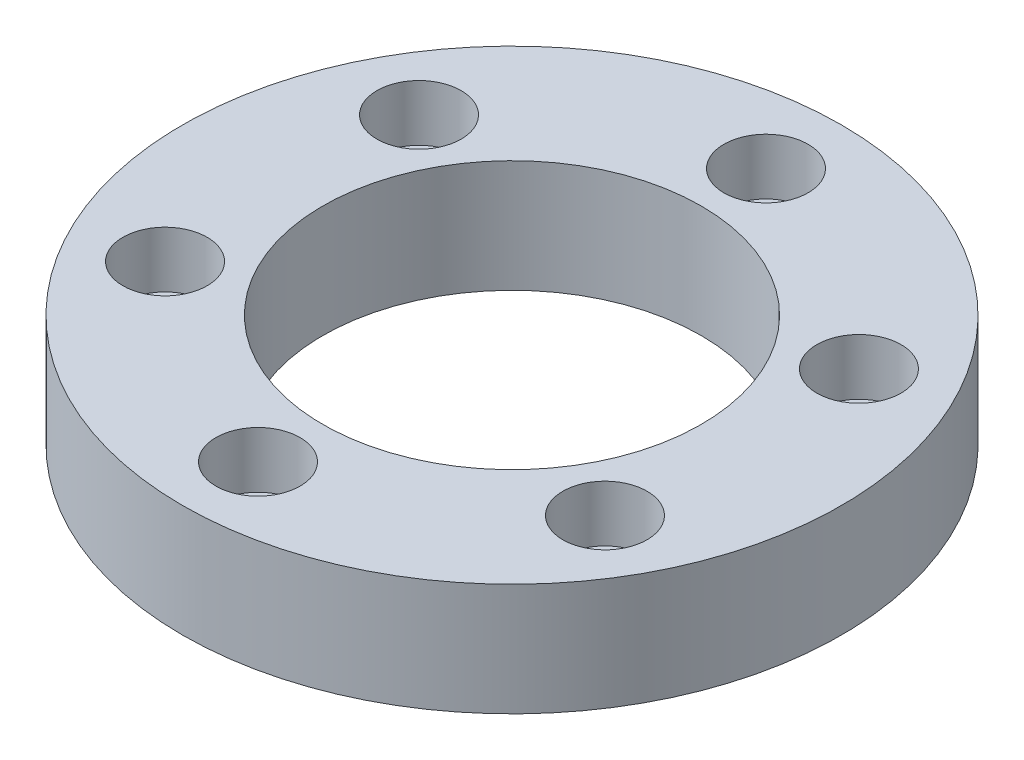
ISO-10303-21;
HEADER;
FILE_DESCRIPTION(('STEP AP214'),'2;1');
FILE_NAME('part.step','',(''),(''),'','','');
FILE_SCHEMA(('AUTOMOTIVE_DESIGN { 1 0 10303 214 1 1 1 1 }'));
ENDSEC;
DATA;
#1=APPLICATION_CONTEXT('core data for automotive mechanical design processes');
#2=APPLICATION_PROTOCOL_DEFINITION('international standard','automotive_design',2000,#1);
#3=PRODUCT_CONTEXT('',#1,'mechanical');
#4=PRODUCT('Part','Part','',(#3));
#5=PRODUCT_RELATED_PRODUCT_CATEGORY('part','',(#4));
#6=PRODUCT_DEFINITION_FORMATION('','',#4);
#7=PRODUCT_DEFINITION_CONTEXT('part definition',#1,'design');
#8=PRODUCT_DEFINITION('design','',#6,#7);
#9=PRODUCT_DEFINITION_SHAPE('','',#8);
#10=(LENGTH_UNIT() NAMED_UNIT(*) SI_UNIT(.MILLI.,.METRE.));
#11=(NAMED_UNIT(*) PLANE_ANGLE_UNIT() SI_UNIT($,.RADIAN.));
#12=(NAMED_UNIT(*) SI_UNIT($,.STERADIAN.) SOLID_ANGLE_UNIT());
#13=UNCERTAINTY_MEASURE_WITH_UNIT(LENGTH_MEASURE(1.E-05),#10,'distance_accuracy_value','');
#14=(GEOMETRIC_REPRESENTATION_CONTEXT(3) GLOBAL_UNCERTAINTY_ASSIGNED_CONTEXT((#13)) GLOBAL_UNIT_ASSIGNED_CONTEXT((#10,
#11,#12)) REPRESENTATION_CONTEXT('',''));
#15=CARTESIAN_POINT('',(0.,0.,0.));
#16=DIRECTION('',(0.,0.,1.));
#17=DIRECTION('',(1.,0.,0.));
#18=AXIS2_PLACEMENT_3D('',#15,#16,#17);
#19=CARTESIAN_POINT('',(-15.6750598084982,-2.,-9.05000000000018));
#20=DIRECTION('',(0.,1.,0.));
#21=DIRECTION('',(0.,0.,1.));
#22=AXIS2_PLACEMENT_3D('',#19,#20,#21);
#23=CYLINDRICAL_SURFACE('',#22,1.75);
#24=CARTESIAN_POINT('',(-15.6750598084982,0.,-9.05000000000018));
#25=DIRECTION('',(0.,-1.,0.));
#26=DIRECTION('',(0.,0.,-1.));
#27=AXIS2_PLACEMENT_3D('',#24,#25,#26);
#28=CIRCLE('',#27,1.75);
#29=CARTESIAN_POINT('',(-15.6750598084982,0.,-10.8000000000002));
#30=VERTEX_POINT('',#29);
#31=EDGE_CURVE('E74',#30,#30,#28,.T.);
#32=ORIENTED_EDGE('',*,*,#31,.T.);
#33=EDGE_LOOP('',(#32));
#34=FACE_BOUND('',#33,.T.);
#35=CARTESIAN_POINT('',(-15.6750598084982,4.,-9.05000000000018));
#36=DIRECTION('',(0.,1.,0.));
#37=DIRECTION('',(0.,0.,1.));
#38=AXIS2_PLACEMENT_3D('',#35,#36,#37);
#39=CIRCLE('',#38,1.75);
#40=CARTESIAN_POINT('',(-15.6750598084982,4.,-7.30000000000018));
#41=VERTEX_POINT('',#40);
#42=EDGE_CURVE('E81',#41,#41,#39,.T.);
#43=ORIENTED_EDGE('',*,*,#42,.T.);
#44=EDGE_LOOP('',(#43));
#45=FACE_BOUND('',#44,.T.);
#46=ADVANCED_FACE('F39',(#34,#45),#23,.F.);
#47=CARTESIAN_POINT('',(-15.6750598084984,-2.,9.04999999999986));
#48=DIRECTION('',(0.,1.,0.));
#49=DIRECTION('',(0.,0.,1.));
#50=AXIS2_PLACEMENT_3D('',#47,#48,#49);
#51=CYLINDRICAL_SURFACE('',#50,1.75);
#52=CARTESIAN_POINT('',(-15.6750598084984,0.,9.04999999999986));
#53=DIRECTION('',(0.,-1.,0.));
#54=DIRECTION('',(0.,0.,-1.));
#55=AXIS2_PLACEMENT_3D('',#52,#53,#54);
#56=CIRCLE('',#55,1.75);
#57=CARTESIAN_POINT('',(-15.6750598084984,0.,7.29999999999985));
#58=VERTEX_POINT('',#57);
#59=EDGE_CURVE('E71',#58,#58,#56,.T.);
#60=ORIENTED_EDGE('',*,*,#59,.T.);
#61=EDGE_LOOP('',(#60));
#62=FACE_BOUND('',#61,.T.);
#63=CARTESIAN_POINT('',(-15.6750598084984,4.,9.04999999999986));
#64=DIRECTION('',(0.,1.,0.));
#65=DIRECTION('',(0.,0.,1.));
#66=AXIS2_PLACEMENT_3D('',#63,#64,#65);
#67=CIRCLE('',#66,1.75);
#68=CARTESIAN_POINT('',(-15.6750598084984,4.,10.7999999999999));
#69=VERTEX_POINT('',#68);
#70=EDGE_CURVE('E100',#69,#69,#67,.T.);
#71=ORIENTED_EDGE('',*,*,#70,.T.);
#72=EDGE_LOOP('',(#71));
#73=FACE_BOUND('',#72,.T.);
#74=ADVANCED_FACE('F172',(#62,#73),#51,.F.);
#75=CARTESIAN_POINT('',(-1.26391624466121E-13,-2.,18.1));
#76=DIRECTION('',(0.,1.,0.));
#77=DIRECTION('',(0.,0.,1.));
#78=AXIS2_PLACEMENT_3D('',#75,#76,#77);
#79=CYLINDRICAL_SURFACE('',#78,1.75);
#80=CARTESIAN_POINT('',(-1.26391624466121E-13,0.,18.1));
#81=DIRECTION('',(0.,-1.,0.));
#82=DIRECTION('',(0.,0.,-1.));
#83=AXIS2_PLACEMENT_3D('',#80,#81,#82);
#84=CIRCLE('',#83,1.75);
#85=CARTESIAN_POINT('',(-1.26391624466121E-13,0.,16.35));
#86=VERTEX_POINT('',#85);
#87=EDGE_CURVE('E68',#86,#86,#84,.T.);
#88=ORIENTED_EDGE('',*,*,#87,.T.);
#89=EDGE_LOOP('',(#88));
#90=FACE_BOUND('',#89,.T.);
#91=CARTESIAN_POINT('',(-1.26391624466121E-13,4.,18.1));
#92=DIRECTION('',(0.,1.,0.));
#93=DIRECTION('',(0.,0.,1.));
#94=AXIS2_PLACEMENT_3D('',#91,#92,#93);
#95=CIRCLE('',#94,1.75);
#96=CARTESIAN_POINT('',(-1.26391624466121E-13,4.,19.85));
#97=VERTEX_POINT('',#96);
#98=EDGE_CURVE('E90',#97,#97,#95,.T.);
#99=ORIENTED_EDGE('',*,*,#98,.T.);
#100=EDGE_LOOP('',(#99));
#101=FACE_BOUND('',#100,.T.);
#102=ADVANCED_FACE('F178',(#90,#101),#79,.F.);
#103=CARTESIAN_POINT('',(15.6750598084983,-2.,9.05000000000008));
#104=DIRECTION('',(0.,1.,0.));
#105=DIRECTION('',(0.,0.,1.));
#106=AXIS2_PLACEMENT_3D('',#103,#104,#105);
#107=CYLINDRICAL_SURFACE('',#106,1.75);
#108=CARTESIAN_POINT('',(15.6750598084983,0.,9.05000000000008));
#109=DIRECTION('',(0.,-1.,0.));
#110=DIRECTION('',(0.,0.,-1.));
#111=AXIS2_PLACEMENT_3D('',#108,#109,#110);
#112=CIRCLE('',#111,1.75);
#113=CARTESIAN_POINT('',(15.6750598084983,0.,7.30000000000008));
#114=VERTEX_POINT('',#113);
#115=EDGE_CURVE('E65',#114,#114,#112,.T.);
#116=ORIENTED_EDGE('',*,*,#115,.T.);
#117=EDGE_LOOP('',(#116));
#118=FACE_BOUND('',#117,.T.);
#119=CARTESIAN_POINT('',(15.6750598084983,4.,9.05000000000008));
#120=DIRECTION('',(0.,1.,0.));
#121=DIRECTION('',(0.,0.,1.));
#122=AXIS2_PLACEMENT_3D('',#119,#120,#121);
#123=CIRCLE('',#122,1.75);
#124=CARTESIAN_POINT('',(15.6750598084983,4.,10.8000000000001));
#125=VERTEX_POINT('',#124);
#126=EDGE_CURVE('E126',#125,#125,#123,.T.);
#127=ORIENTED_EDGE('',*,*,#126,.T.);
#128=EDGE_LOOP('',(#127));
#129=FACE_BOUND('',#128,.T.);
#130=ADVANCED_FACE('F132',(#118,#129),#107,.F.);
#131=CARTESIAN_POINT('',(15.6750598084984,-2.,-9.04999999999997));
#132=DIRECTION('',(0.,1.,0.));
#133=DIRECTION('',(0.,0.,1.));
#134=AXIS2_PLACEMENT_3D('',#131,#132,#133);
#135=CYLINDRICAL_SURFACE('',#134,1.75);
#136=CARTESIAN_POINT('',(15.6750598084984,0.,-9.04999999999997));
#137=DIRECTION('',(0.,-1.,0.));
#138=DIRECTION('',(0.,0.,-1.));
#139=AXIS2_PLACEMENT_3D('',#136,#137,#138);
#140=CIRCLE('',#139,1.75);
#141=CARTESIAN_POINT('',(15.6750598084984,0.,-10.8));
#142=VERTEX_POINT('',#141);
#143=EDGE_CURVE('E62',#142,#142,#140,.T.);
#144=ORIENTED_EDGE('',*,*,#143,.T.);
#145=EDGE_LOOP('',(#144));
#146=FACE_BOUND('',#145,.T.);
#147=CARTESIAN_POINT('',(15.6750598084984,4.,-9.04999999999997));
#148=DIRECTION('',(0.,1.,0.));
#149=DIRECTION('',(0.,0.,1.));
#150=AXIS2_PLACEMENT_3D('',#147,#148,#149);
#151=CIRCLE('',#150,1.75);
#152=CARTESIAN_POINT('',(15.6750598084984,4.,-7.29999999999997));
#153=VERTEX_POINT('',#152);
#154=EDGE_CURVE('E109',#153,#153,#151,.T.);
#155=ORIENTED_EDGE('',*,*,#154,.T.);
#156=EDGE_LOOP('',(#155));
#157=FACE_BOUND('',#156,.T.);
#158=ADVANCED_FACE('F183',(#146,#157),#135,.F.);
#159=CARTESIAN_POINT('',(0.,-2.,-18.1));
#160=DIRECTION('',(0.,1.,0.));
#161=DIRECTION('',(0.,0.,1.));
#162=AXIS2_PLACEMENT_3D('',#159,#160,#161);
#163=CYLINDRICAL_SURFACE('',#162,1.75);
#164=CARTESIAN_POINT('',(0.,0.,-18.1));
#165=DIRECTION('',(0.,-1.,0.));
#166=DIRECTION('',(0.,0.,-1.));
#167=AXIS2_PLACEMENT_3D('',#164,#165,#166);
#168=CIRCLE('',#167,1.75);
#169=CARTESIAN_POINT('',(0.,0.,-19.85));
#170=VERTEX_POINT('',#169);
#171=EDGE_CURVE('E59',#170,#170,#168,.T.);
#172=ORIENTED_EDGE('',*,*,#171,.T.);
#173=EDGE_LOOP('',(#172));
#174=FACE_BOUND('',#173,.T.);
#175=CARTESIAN_POINT('',(0.,4.,-18.1));
#176=DIRECTION('',(0.,1.,0.));
#177=DIRECTION('',(0.,0.,1.));
#178=AXIS2_PLACEMENT_3D('',#175,#176,#177);
#179=CIRCLE('',#178,1.75);
#180=CARTESIAN_POINT('',(0.,4.,-16.35));
#181=VERTEX_POINT('',#180);
#182=EDGE_CURVE('E118',#181,#181,#179,.T.);
#183=ORIENTED_EDGE('',*,*,#182,.T.);
#184=EDGE_LOOP('',(#183));
#185=FACE_BOUND('',#184,.T.);
#186=ADVANCED_FACE('F193',(#174,#185),#163,.F.);
#187=CARTESIAN_POINT('',(0.,0.,-13.485));
#188=DIRECTION('',(0.,-1.,0.));
#189=DIRECTION('',(0.,0.,-1.));
#190=AXIS2_PLACEMENT_3D('',#187,#188,#189);
#191=PLANE('',#190);
#192=ORIENTED_EDGE('',*,*,#171,.F.);
#193=EDGE_LOOP('',(#192));
#194=FACE_BOUND('',#193,.T.);
#195=ORIENTED_EDGE('',*,*,#143,.F.);
#196=EDGE_LOOP('',(#195));
#197=FACE_BOUND('',#196,.T.);
#198=ORIENTED_EDGE('',*,*,#115,.F.);
#199=EDGE_LOOP('',(#198));
#200=FACE_BOUND('',#199,.T.);
#201=ORIENTED_EDGE('',*,*,#87,.F.);
#202=EDGE_LOOP('',(#201));
#203=FACE_BOUND('',#202,.T.);
#204=ORIENTED_EDGE('',*,*,#59,.F.);
#205=EDGE_LOOP('',(#204));
#206=FACE_BOUND('',#205,.T.);
#207=ORIENTED_EDGE('',*,*,#31,.F.);
#208=EDGE_LOOP('',(#207));
#209=FACE_BOUND('',#208,.T.);
#210=CARTESIAN_POINT('',(0.,0.,0.));
#211=DIRECTION('',(0.,-1.,0.));
#212=DIRECTION('',(0.,0.,-1.));
#213=AXIS2_PLACEMENT_3D('',#210,#211,#212);
#214=CIRCLE('',#213,23.485);
#215=CARTESIAN_POINT('',(0.,0.,-23.485));
#216=VERTEX_POINT('',#215);
#217=EDGE_CURVE('E10',#216,#216,#214,.T.);
#218=ORIENTED_EDGE('',*,*,#217,.T.);
#219=EDGE_LOOP('',(#218));
#220=FACE_BOUND('',#219,.T.);
#221=CARTESIAN_POINT('',(0.,0.,0.));
#222=DIRECTION('',(0.,-1.,0.));
#223=DIRECTION('',(0.,0.,-1.));
#224=AXIS2_PLACEMENT_3D('',#221,#222,#223);
#225=CIRCLE('',#224,13.485);
#226=CARTESIAN_POINT('',(0.,0.,-13.485));
#227=VERTEX_POINT('',#226);
#228=EDGE_CURVE('E54',#227,#227,#225,.T.);
#229=ORIENTED_EDGE('',*,*,#228,.F.);
#230=EDGE_LOOP('',(#229));
#231=FACE_BOUND('',#230,.T.);
#232=ADVANCED_FACE('F41',(#194,#197,#200,#203,#206,#209,#220,#231),#191,.T.);
#233=CARTESIAN_POINT('',(0.,0.,0.));
#234=DIRECTION('',(0.,-1.,0.));
#235=DIRECTION('',(0.,0.,-1.));
#236=AXIS2_PLACEMENT_3D('',#233,#234,#235);
#237=CYLINDRICAL_SURFACE('',#236,23.485);
#238=CARTESIAN_POINT('',(0.,8.,0.));
#239=DIRECTION('',(0.,-1.,0.));
#240=DIRECTION('',(0.,0.,-1.));
#241=AXIS2_PLACEMENT_3D('',#238,#239,#240);
#242=CIRCLE('',#241,23.485);
#243=CARTESIAN_POINT('',(0.,8.,-23.485));
#244=VERTEX_POINT('',#243);
#245=EDGE_CURVE('E46',#244,#244,#242,.T.);
#246=ORIENTED_EDGE('',*,*,#245,.T.);
#247=EDGE_LOOP('',(#246));
#248=FACE_BOUND('',#247,.T.);
#249=ORIENTED_EDGE('',*,*,#217,.F.);
#250=EDGE_LOOP('',(#249));
#251=FACE_BOUND('',#250,.T.);
#252=ADVANCED_FACE('F152',(#248,#251),#237,.T.);
#253=CARTESIAN_POINT('',(0.,8.,-23.485));
#254=DIRECTION('',(0.,1.,0.));
#255=DIRECTION('',(0.,0.,1.));
#256=AXIS2_PLACEMENT_3D('',#253,#254,#255);
#257=PLANE('',#256);
#258=CARTESIAN_POINT('',(0.,8.,-18.1));
#259=DIRECTION('',(0.,1.,0.));
#260=DIRECTION('',(0.,0.,1.));
#261=AXIS2_PLACEMENT_3D('',#258,#259,#260);
#262=CIRCLE('',#261,3.);
#263=CARTESIAN_POINT('',(0.,8.,-15.1));
#264=VERTEX_POINT('',#263);
#265=EDGE_CURVE('E113',#264,#264,#262,.T.);
#266=ORIENTED_EDGE('',*,*,#265,.F.);
#267=EDGE_LOOP('',(#266));
#268=FACE_BOUND('',#267,.T.);
#269=CARTESIAN_POINT('',(15.6750598084984,8.,-9.04999999999997));
#270=DIRECTION('',(0.,1.,0.));
#271=DIRECTION('',(0.,0.,1.));
#272=AXIS2_PLACEMENT_3D('',#269,#270,#271);
#273=CIRCLE('',#272,3.);
#274=CARTESIAN_POINT('',(15.6750598084984,8.,-6.04999999999997));
#275=VERTEX_POINT('',#274);
#276=EDGE_CURVE('E104',#275,#275,#273,.T.);
#277=ORIENTED_EDGE('',*,*,#276,.F.);
#278=EDGE_LOOP('',(#277));
#279=FACE_BOUND('',#278,.T.);
#280=CARTESIAN_POINT('',(-15.6750598084984,8.,9.04999999999986));
#281=DIRECTION('',(0.,1.,0.));
#282=DIRECTION('',(0.,0.,1.));
#283=AXIS2_PLACEMENT_3D('',#280,#281,#282);
#284=CIRCLE('',#283,3.);
#285=CARTESIAN_POINT('',(-15.6750598084984,8.,12.0499999999999));
#286=VERTEX_POINT('',#285);
#287=EDGE_CURVE('E95',#286,#286,#284,.T.);
#288=ORIENTED_EDGE('',*,*,#287,.F.);
#289=EDGE_LOOP('',(#288));
#290=FACE_BOUND('',#289,.T.);
#291=CARTESIAN_POINT('',(-1.26391624466121E-13,8.,18.1));
#292=DIRECTION('',(0.,1.,0.));
#293=DIRECTION('',(0.,0.,1.));
#294=AXIS2_PLACEMENT_3D('',#291,#292,#293);
#295=CIRCLE('',#294,3.);
#296=CARTESIAN_POINT('',(-1.26391624466121E-13,8.,21.1));
#297=VERTEX_POINT('',#296);
#298=EDGE_CURVE('E87',#297,#297,#295,.T.);
#299=ORIENTED_EDGE('',*,*,#298,.F.);
#300=EDGE_LOOP('',(#299));
#301=FACE_BOUND('',#300,.T.);
#302=CARTESIAN_POINT('',(15.6750598084983,8.,9.05000000000008));
#303=DIRECTION('',(0.,1.,0.));
#304=DIRECTION('',(0.,0.,1.));
#305=AXIS2_PLACEMENT_3D('',#302,#303,#304);
#306=CIRCLE('',#305,3.);
#307=CARTESIAN_POINT('',(15.6750598084983,8.,12.0500000000001));
#308=VERTEX_POINT('',#307);
#309=EDGE_CURVE('E123',#308,#308,#306,.T.);
#310=ORIENTED_EDGE('',*,*,#309,.F.);
#311=EDGE_LOOP('',(#310));
#312=FACE_BOUND('',#311,.T.);
#313=CARTESIAN_POINT('',(-15.6750598084982,8.,-9.05000000000018));
#314=DIRECTION('',(0.,1.,0.));
#315=DIRECTION('',(0.,0.,1.));
#316=AXIS2_PLACEMENT_3D('',#313,#314,#315);
#317=CIRCLE('',#316,3.);
#318=CARTESIAN_POINT('',(-15.6750598084982,8.,-6.05000000000018));
#319=VERTEX_POINT('',#318);
#320=EDGE_CURVE('E78',#319,#319,#317,.T.);
#321=ORIENTED_EDGE('',*,*,#320,.F.);
#322=EDGE_LOOP('',(#321));
#323=FACE_BOUND('',#322,.T.);
#324=CARTESIAN_POINT('',(0.,8.,0.));
#325=DIRECTION('',(0.,-1.,0.));
#326=DIRECTION('',(0.,0.,-1.));
#327=AXIS2_PLACEMENT_3D('',#324,#325,#326);
#328=CIRCLE('',#327,13.485);
#329=CARTESIAN_POINT('',(0.,8.,-13.485));
#330=VERTEX_POINT('',#329);
#331=EDGE_CURVE('E50',#330,#330,#328,.T.);
#332=ORIENTED_EDGE('',*,*,#331,.T.);
#333=EDGE_LOOP('',(#332));
#334=FACE_BOUND('',#333,.T.);
#335=ORIENTED_EDGE('',*,*,#245,.F.);
#336=EDGE_LOOP('',(#335));
#337=FACE_BOUND('',#336,.T.);
#338=ADVANCED_FACE('F148',(#268,#279,#290,#301,#312,#323,#334,#337),#257,.T.);
#339=CARTESIAN_POINT('',(0.,0.,0.));
#340=DIRECTION('',(0.,-1.,0.));
#341=DIRECTION('',(0.,0.,-1.));
#342=AXIS2_PLACEMENT_3D('',#339,#340,#341);
#343=CYLINDRICAL_SURFACE('',#342,13.485);
#344=ORIENTED_EDGE('',*,*,#228,.T.);
#345=EDGE_LOOP('',(#344));
#346=FACE_BOUND('',#345,.T.);
#347=ORIENTED_EDGE('',*,*,#331,.F.);
#348=EDGE_LOOP('',(#347));
#349=FACE_BOUND('',#348,.T.);
#350=ADVANCED_FACE('F151',(#346,#349),#343,.F.);
#351=CARTESIAN_POINT('',(0.,4.,-18.1));
#352=DIRECTION('',(0.,1.,0.));
#353=DIRECTION('',(0.,0.,1.));
#354=AXIS2_PLACEMENT_3D('',#351,#352,#353);
#355=CYLINDRICAL_SURFACE('',#354,3.);
#356=CARTESIAN_POINT('',(0.,4.,-18.1));
#357=DIRECTION('',(0.,1.,0.));
#358=DIRECTION('',(0.,0.,1.));
#359=AXIS2_PLACEMENT_3D('',#356,#357,#358);
#360=CIRCLE('',#359,3.);
#361=CARTESIAN_POINT('',(0.,4.,-15.1));
#362=VERTEX_POINT('',#361);
#363=EDGE_CURVE('E82',#362,#362,#360,.T.);
#364=ORIENTED_EDGE('',*,*,#363,.F.);
#365=EDGE_LOOP('',(#364));
#366=FACE_BOUND('',#365,.T.);
#367=ORIENTED_EDGE('',*,*,#265,.T.);
#368=EDGE_LOOP('',(#367));
#369=FACE_BOUND('',#368,.T.);
#370=ADVANCED_FACE('F161',(#366,#369),#355,.F.);
#371=CARTESIAN_POINT('',(0.,4.,0.));
#372=DIRECTION('',(0.,1.,0.));
#373=DIRECTION('',(0.,0.,1.));
#374=AXIS2_PLACEMENT_3D('',#371,#372,#373);
#375=PLANE('',#374);
#376=ORIENTED_EDGE('',*,*,#182,.F.);
#377=EDGE_LOOP('',(#376));
#378=FACE_BOUND('',#377,.T.);
#379=ORIENTED_EDGE('',*,*,#363,.T.);
#380=EDGE_LOOP('',(#379));
#381=FACE_BOUND('',#380,.T.);
#382=ADVANCED_FACE('F167',(#378,#381),#375,.T.);
#383=CARTESIAN_POINT('',(15.6750598084984,4.,-9.04999999999997));
#384=DIRECTION('',(0.,1.,0.));
#385=DIRECTION('',(0.,0.,1.));
#386=AXIS2_PLACEMENT_3D('',#383,#384,#385);
#387=CYLINDRICAL_SURFACE('',#386,3.);
#388=CARTESIAN_POINT('',(15.6750598084984,4.,-9.04999999999997));
#389=DIRECTION('',(0.,1.,0.));
#390=DIRECTION('',(0.,0.,1.));
#391=AXIS2_PLACEMENT_3D('',#388,#389,#390);
#392=CIRCLE('',#391,3.);
#393=CARTESIAN_POINT('',(15.6750598084984,4.,-6.04999999999997));
#394=VERTEX_POINT('',#393);
#395=EDGE_CURVE('E110',#394,#394,#392,.T.);
#396=ORIENTED_EDGE('',*,*,#395,.F.);
#397=EDGE_LOOP('',(#396));
#398=FACE_BOUND('',#397,.T.);
#399=ORIENTED_EDGE('',*,*,#276,.T.);
#400=EDGE_LOOP('',(#399));
#401=FACE_BOUND('',#400,.T.);
#402=ADVANCED_FACE('F253',(#398,#401),#387,.F.);
#403=CARTESIAN_POINT('',(0.,4.,0.));
#404=DIRECTION('',(0.,1.,0.));
#405=DIRECTION('',(0.,0.,1.));
#406=AXIS2_PLACEMENT_3D('',#403,#404,#405);
#407=PLANE('',#406);
#408=ORIENTED_EDGE('',*,*,#154,.F.);
#409=EDGE_LOOP('',(#408));
#410=FACE_BOUND('',#409,.T.);
#411=ORIENTED_EDGE('',*,*,#395,.T.);
#412=EDGE_LOOP('',(#411));
#413=FACE_BOUND('',#412,.T.);
#414=ADVANCED_FACE('F144',(#410,#413),#407,.T.);
#415=CARTESIAN_POINT('',(15.6750598084983,4.,9.05000000000008));
#416=DIRECTION('',(0.,1.,0.));
#417=DIRECTION('',(0.,0.,1.));
#418=AXIS2_PLACEMENT_3D('',#415,#416,#417);
#419=CYLINDRICAL_SURFACE('',#418,3.);
#420=CARTESIAN_POINT('',(15.6750598084983,4.,9.05000000000008));
#421=DIRECTION('',(0.,1.,0.));
#422=DIRECTION('',(0.,0.,1.));
#423=AXIS2_PLACEMENT_3D('',#420,#421,#422);
#424=CIRCLE('',#423,3.);
#425=CARTESIAN_POINT('',(15.6750598084983,4.,12.0500000000001));
#426=VERTEX_POINT('',#425);
#427=EDGE_CURVE('E91',#426,#426,#424,.T.);
#428=ORIENTED_EDGE('',*,*,#427,.F.);
#429=EDGE_LOOP('',(#428));
#430=FACE_BOUND('',#429,.T.);
#431=ORIENTED_EDGE('',*,*,#309,.T.);
#432=EDGE_LOOP('',(#431));
#433=FACE_BOUND('',#432,.T.);
#434=ADVANCED_FACE('F138',(#430,#433),#419,.F.);
#435=CARTESIAN_POINT('',(0.,4.,0.));
#436=DIRECTION('',(0.,1.,0.));
#437=DIRECTION('',(0.,0.,1.));
#438=AXIS2_PLACEMENT_3D('',#435,#436,#437);
#439=PLANE('',#438);
#440=ORIENTED_EDGE('',*,*,#126,.F.);
#441=EDGE_LOOP('',(#440));
#442=FACE_BOUND('',#441,.T.);
#443=ORIENTED_EDGE('',*,*,#427,.T.);
#444=EDGE_LOOP('',(#443));
#445=FACE_BOUND('',#444,.T.);
#446=ADVANCED_FACE('F134',(#442,#445),#439,.T.);
#447=CARTESIAN_POINT('',(-1.26391624466121E-13,4.,18.1));
#448=DIRECTION('',(0.,1.,0.));
#449=DIRECTION('',(0.,0.,1.));
#450=AXIS2_PLACEMENT_3D('',#447,#448,#449);
#451=CYLINDRICAL_SURFACE('',#450,3.);
#452=CARTESIAN_POINT('',(-1.26391624466121E-13,4.,18.1));
#453=DIRECTION('',(0.,1.,0.));
#454=DIRECTION('',(0.,0.,1.));
#455=AXIS2_PLACEMENT_3D('',#452,#453,#454);
#456=CIRCLE('',#455,3.);
#457=CARTESIAN_POINT('',(-1.26391624466121E-13,4.,21.1));
#458=VERTEX_POINT('',#457);
#459=EDGE_CURVE('E92',#458,#458,#456,.T.);
#460=ORIENTED_EDGE('',*,*,#459,.F.);
#461=EDGE_LOOP('',(#460));
#462=FACE_BOUND('',#461,.T.);
#463=ORIENTED_EDGE('',*,*,#298,.T.);
#464=EDGE_LOOP('',(#463));
#465=FACE_BOUND('',#464,.T.);
#466=ADVANCED_FACE('F137',(#462,#465),#451,.F.);
#467=CARTESIAN_POINT('',(0.,4.,0.));
#468=DIRECTION('',(0.,1.,0.));
#469=DIRECTION('',(0.,0.,1.));
#470=AXIS2_PLACEMENT_3D('',#467,#468,#469);
#471=PLANE('',#470);
#472=ORIENTED_EDGE('',*,*,#98,.F.);
#473=EDGE_LOOP('',(#472));
#474=FACE_BOUND('',#473,.T.);
#475=ORIENTED_EDGE('',*,*,#459,.T.);
#476=EDGE_LOOP('',(#475));
#477=FACE_BOUND('',#476,.T.);
#478=ADVANCED_FACE('F220',(#474,#477),#471,.T.);
#479=CARTESIAN_POINT('',(-15.6750598084984,4.,9.04999999999986));
#480=DIRECTION('',(0.,1.,0.));
#481=DIRECTION('',(0.,0.,1.));
#482=AXIS2_PLACEMENT_3D('',#479,#480,#481);
#483=CYLINDRICAL_SURFACE('',#482,3.);
#484=CARTESIAN_POINT('',(-15.6750598084984,4.,9.04999999999986));
#485=DIRECTION('',(0.,1.,0.));
#486=DIRECTION('',(0.,0.,1.));
#487=AXIS2_PLACEMENT_3D('',#484,#485,#486);
#488=CIRCLE('',#487,3.);
#489=CARTESIAN_POINT('',(-15.6750598084984,4.,12.0499999999999));
#490=VERTEX_POINT('',#489);
#491=EDGE_CURVE('E101',#490,#490,#488,.T.);
#492=ORIENTED_EDGE('',*,*,#491,.F.);
#493=EDGE_LOOP('',(#492));
#494=FACE_BOUND('',#493,.T.);
#495=ORIENTED_EDGE('',*,*,#287,.T.);
#496=EDGE_LOOP('',(#495));
#497=FACE_BOUND('',#496,.T.);
#498=ADVANCED_FACE('F214',(#494,#497),#483,.F.);
#499=CARTESIAN_POINT('',(0.,4.,0.));
#500=DIRECTION('',(0.,1.,0.));
#501=DIRECTION('',(0.,0.,1.));
#502=AXIS2_PLACEMENT_3D('',#499,#500,#501);
#503=PLANE('',#502);
#504=ORIENTED_EDGE('',*,*,#70,.F.);
#505=EDGE_LOOP('',(#504));
#506=FACE_BOUND('',#505,.T.);
#507=ORIENTED_EDGE('',*,*,#491,.T.);
#508=EDGE_LOOP('',(#507));
#509=FACE_BOUND('',#508,.T.);
#510=ADVANCED_FACE('F210',(#506,#509),#503,.T.);
#511=CARTESIAN_POINT('',(-15.6750598084982,4.,-9.05000000000018));
#512=DIRECTION('',(0.,1.,0.));
#513=DIRECTION('',(0.,0.,1.));
#514=AXIS2_PLACEMENT_3D('',#511,#512,#513);
#515=CYLINDRICAL_SURFACE('',#514,3.);
#516=CARTESIAN_POINT('',(-15.6750598084982,4.,-9.05000000000018));
#517=DIRECTION('',(0.,1.,0.));
#518=DIRECTION('',(0.,0.,1.));
#519=AXIS2_PLACEMENT_3D('',#516,#517,#518);
#520=CIRCLE('',#519,3.);
#521=CARTESIAN_POINT('',(-15.6750598084982,4.,-6.05000000000018));
#522=VERTEX_POINT('',#521);
#523=EDGE_CURVE('E77',#522,#522,#520,.T.);
#524=ORIENTED_EDGE('',*,*,#523,.F.);
#525=EDGE_LOOP('',(#524));
#526=FACE_BOUND('',#525,.T.);
#527=ORIENTED_EDGE('',*,*,#320,.T.);
#528=EDGE_LOOP('',(#527));
#529=FACE_BOUND('',#528,.T.);
#530=ADVANCED_FACE('F213',(#526,#529),#515,.F.);
#531=CARTESIAN_POINT('',(0.,4.,0.));
#532=DIRECTION('',(0.,1.,0.));
#533=DIRECTION('',(0.,0.,1.));
#534=AXIS2_PLACEMENT_3D('',#531,#532,#533);
#535=PLANE('',#534);
#536=ORIENTED_EDGE('',*,*,#42,.F.);
#537=EDGE_LOOP('',(#536));
#538=FACE_BOUND('',#537,.T.);
#539=ORIENTED_EDGE('',*,*,#523,.T.);
#540=EDGE_LOOP('',(#539));
#541=FACE_BOUND('',#540,.T.);
#542=ADVANCED_FACE('F237',(#538,#541),#535,.T.);
#543=CLOSED_SHELL('',(#46,#74,#102,#130,#158,#186,#232,#252,#338,#350,#370,#382,#402,#414,#434,
#446,#466,#478,#498,#510,#530,#542));
#544=MANIFOLD_SOLID_BREP('B2',#543);
#545=ADVANCED_BREP_SHAPE_REPRESENTATION('',(#18,#544),#14);
#546=SHAPE_DEFINITION_REPRESENTATION(#9,#545);
ENDSEC;
END-ISO-10303-21;
